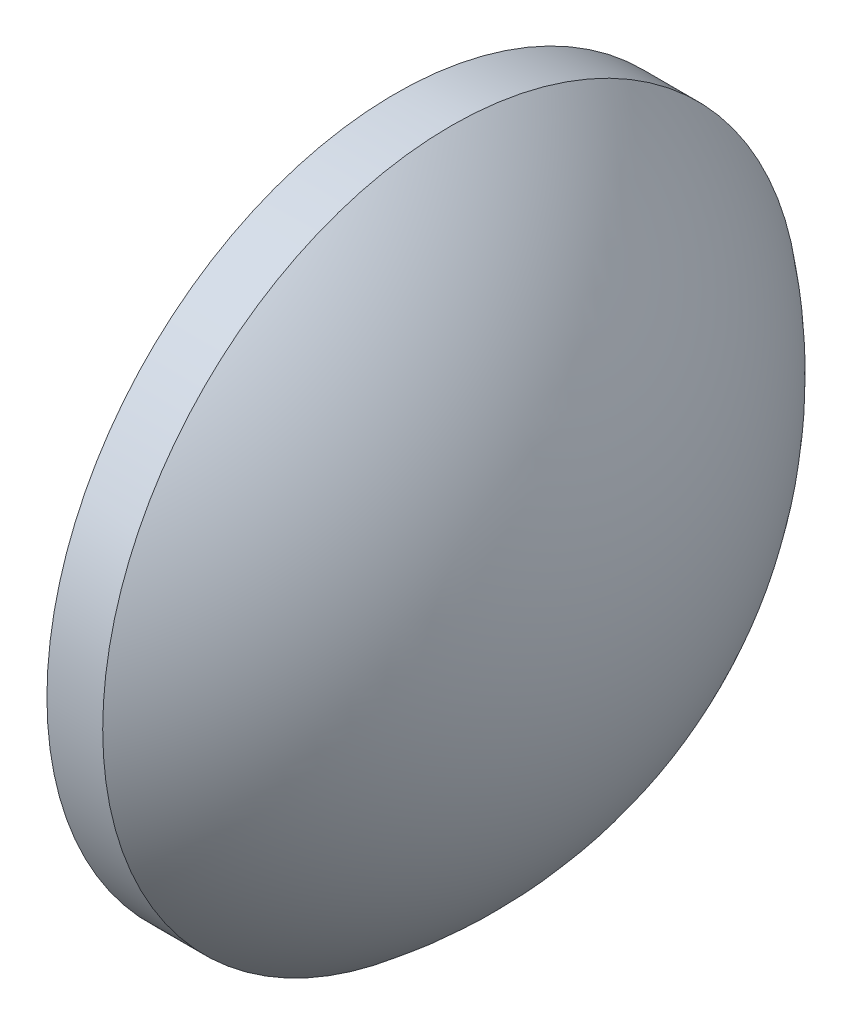
ISO-10303-21;
HEADER;
FILE_DESCRIPTION(('STEP AP214'),'2;1');
FILE_NAME('part.step','',(''),(''),'','','');
FILE_SCHEMA(('AUTOMOTIVE_DESIGN { 1 0 10303 214 1 1 1 1 }'));
ENDSEC;
DATA;
#1=APPLICATION_CONTEXT('core data for automotive mechanical design processes');
#2=APPLICATION_PROTOCOL_DEFINITION('international standard','automotive_design',2000,#1);
#3=PRODUCT_CONTEXT('',#1,'mechanical');
#4=PRODUCT('Part','Part','',(#3));
#5=PRODUCT_RELATED_PRODUCT_CATEGORY('part','',(#4));
#6=PRODUCT_DEFINITION_FORMATION('','',#4);
#7=PRODUCT_DEFINITION_CONTEXT('part definition',#1,'design');
#8=PRODUCT_DEFINITION('design','',#6,#7);
#9=PRODUCT_DEFINITION_SHAPE('','',#8);
#10=(LENGTH_UNIT() NAMED_UNIT(*) SI_UNIT(.MILLI.,.METRE.));
#11=(NAMED_UNIT(*) PLANE_ANGLE_UNIT() SI_UNIT($,.RADIAN.));
#12=(NAMED_UNIT(*) SI_UNIT($,.STERADIAN.) SOLID_ANGLE_UNIT());
#13=UNCERTAINTY_MEASURE_WITH_UNIT(LENGTH_MEASURE(1.E-05),#10,'distance_accuracy_value','');
#14=(GEOMETRIC_REPRESENTATION_CONTEXT(3) GLOBAL_UNCERTAINTY_ASSIGNED_CONTEXT((#13)) GLOBAL_UNIT_ASSIGNED_CONTEXT((#10,
#11,#12)) REPRESENTATION_CONTEXT('',''));
#15=CARTESIAN_POINT('',(0.,0.,0.));
#16=DIRECTION('',(0.,0.,1.));
#17=DIRECTION('',(1.,0.,0.));
#18=AXIS2_PLACEMENT_3D('',#15,#16,#17);
#19=CARTESIAN_POINT('',(371.749549974204,56.8911927201074,0.));
#20=DIRECTION('',(-1.,0.,0.));
#21=DIRECTION('',(0.,1.,0.));
#22=AXIS2_PLACEMENT_3D('',#19,#20,#21);
#23=SPHERICAL_SURFACE('',#22,9.45135135135139);
#24=CARTESIAN_POINT('',(377.500901325556,56.8911927201074,0.));
#25=DIRECTION('',(-1.,0.,0.));
#26=DIRECTION('',(0.,0.,1.));
#27=AXIS2_PLACEMENT_3D('',#24,#25,#26);
#28=CIRCLE('',#27,7.50000000000001);
#29=CARTESIAN_POINT('',(377.500901325556,56.8911927201074,7.50000000000001));
#30=VERTEX_POINT('',#29);
#31=EDGE_CURVE('E10',#30,#30,#28,.T.);
#32=ORIENTED_EDGE('',*,*,#31,.F.);
#33=EDGE_LOOP('',(#32));
#34=FACE_BOUND('',#33,.T.);
#35=ADVANCED_FACE('F35',(#34),#23,.T.);
#36=CARTESIAN_POINT('',(373.460089194822,56.8911927201074,0.));
#37=DIRECTION('',(-1.,0.,0.));
#38=DIRECTION('',(0.,0.,1.));
#39=AXIS2_PLACEMENT_3D('',#36,#37,#38);
#40=CYLINDRICAL_SURFACE('',#39,7.50000000000001);
#41=CARTESIAN_POINT('',(376.300901325556,56.8911927201074,0.));
#42=DIRECTION('',(-1.,0.,0.));
#43=DIRECTION('',(0.,0.,1.));
#44=AXIS2_PLACEMENT_3D('',#41,#42,#43);
#45=CIRCLE('',#44,7.50000000000001);
#46=CARTESIAN_POINT('',(376.300901325556,56.8911927201074,7.50000000000001));
#47=VERTEX_POINT('',#46);
#48=EDGE_CURVE('E41',#47,#47,#45,.T.);
#49=ORIENTED_EDGE('',*,*,#48,.F.);
#50=EDGE_LOOP('',(#49));
#51=FACE_BOUND('',#50,.T.);
#52=ORIENTED_EDGE('',*,*,#31,.T.);
#53=EDGE_LOOP('',(#52));
#54=FACE_BOUND('',#53,.T.);
#55=ADVANCED_FACE('F49',(#51,#54),#40,.T.);
#56=CARTESIAN_POINT('',(376.300901325556,56.8911927201074,0.));
#57=DIRECTION('',(1.,0.,0.));
#58=DIRECTION('',(0.,0.,-1.));
#59=AXIS2_PLACEMENT_3D('',#56,#57,#58);
#60=PLANE('',#59);
#61=ORIENTED_EDGE('',*,*,#48,.T.);
#62=EDGE_LOOP('',(#61));
#63=FACE_BOUND('',#62,.T.);
#64=ADVANCED_FACE('F47',(#63),#60,.F.);
#65=CLOSED_SHELL('',(#35,#55,#64));
#66=MANIFOLD_SOLID_BREP('B2',#65);
#67=ADVANCED_BREP_SHAPE_REPRESENTATION('',(#18,#66),#14);
#68=SHAPE_DEFINITION_REPRESENTATION(#9,#67);
ENDSEC;
END-ISO-10303-21;
